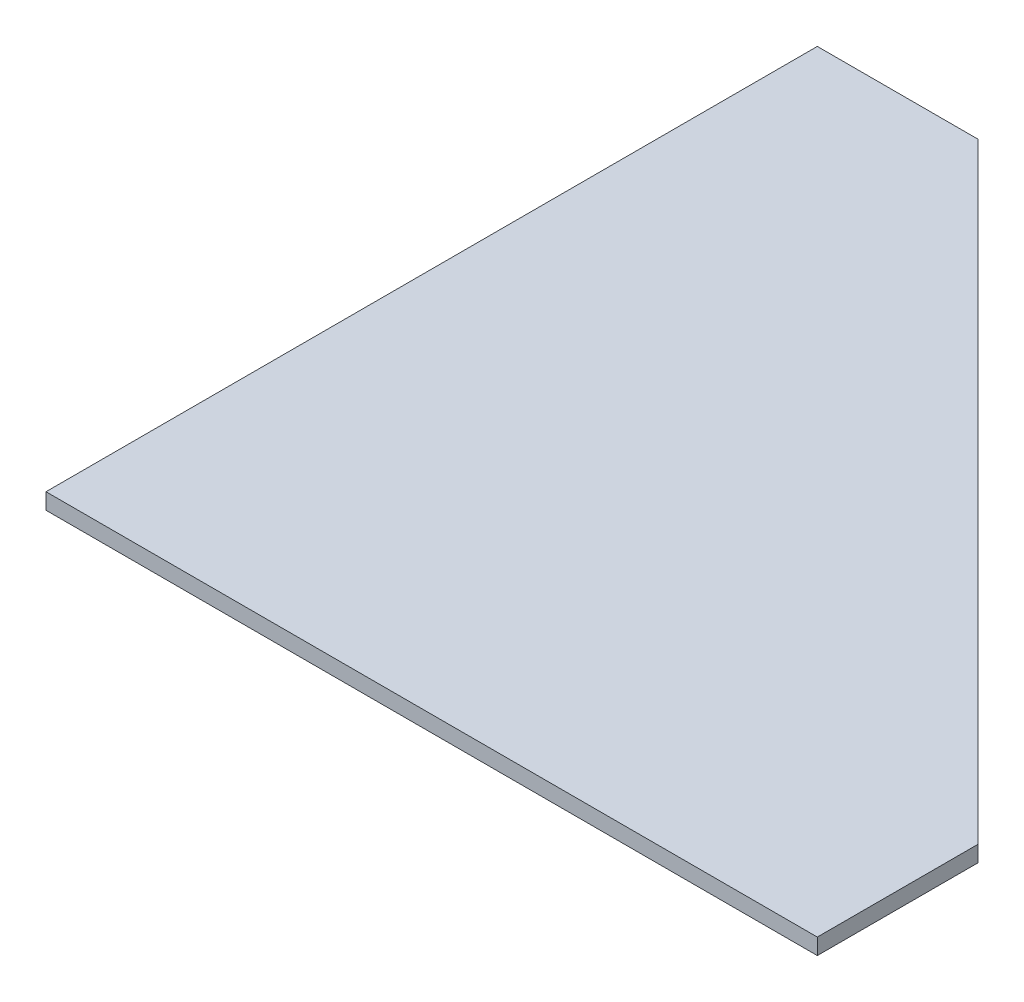
ISO-10303-21;
HEADER;
FILE_DESCRIPTION(('STEP AP214'),'2;1');
FILE_NAME('part.step','',(''),(''),'','','');
FILE_SCHEMA(('AUTOMOTIVE_DESIGN { 1 0 10303 214 1 1 1 1 }'));
ENDSEC;
DATA;
#1=APPLICATION_CONTEXT('core data for automotive mechanical design processes');
#2=APPLICATION_PROTOCOL_DEFINITION('international standard','automotive_design',2000,#1);
#3=PRODUCT_CONTEXT('',#1,'mechanical');
#4=PRODUCT('Part','Part','',(#3));
#5=PRODUCT_RELATED_PRODUCT_CATEGORY('part','',(#4));
#6=PRODUCT_DEFINITION_FORMATION('','',#4);
#7=PRODUCT_DEFINITION_CONTEXT('part definition',#1,'design');
#8=PRODUCT_DEFINITION('design','',#6,#7);
#9=PRODUCT_DEFINITION_SHAPE('','',#8);
#10=(LENGTH_UNIT() NAMED_UNIT(*) SI_UNIT(.MILLI.,.METRE.));
#11=(NAMED_UNIT(*) PLANE_ANGLE_UNIT() SI_UNIT($,.RADIAN.));
#12=(NAMED_UNIT(*) SI_UNIT($,.STERADIAN.) SOLID_ANGLE_UNIT());
#13=UNCERTAINTY_MEASURE_WITH_UNIT(LENGTH_MEASURE(1.E-05),#10,'distance_accuracy_value','');
#14=(GEOMETRIC_REPRESENTATION_CONTEXT(3) GLOBAL_UNCERTAINTY_ASSIGNED_CONTEXT((#13)) GLOBAL_UNIT_ASSIGNED_CONTEXT((#10,
#11,#12)) REPRESENTATION_CONTEXT('',''));
#15=CARTESIAN_POINT('',(0.,0.,0.));
#16=DIRECTION('',(0.,0.,1.));
#17=DIRECTION('',(1.,0.,0.));
#18=AXIS2_PLACEMENT_3D('',#15,#16,#17);
#19=CARTESIAN_POINT('',(0.,12.7,-609.6));
#20=DIRECTION('',(1.,0.,0.));
#21=DIRECTION('',(0.,0.,-1.));
#22=AXIS2_PLACEMENT_3D('',#19,#20,#21);
#23=PLANE('',#22);
#24=DIRECTION('',(0.,0.,1.));
#25=VECTOR('',#24,1.);
#26=CARTESIAN_POINT('',(0.,0.,-609.6));
#27=LINE('',#26,#25);
#28=CARTESIAN_POINT('',(0.,0.,-609.6));
#29=VERTEX_POINT('',#28);
#30=CARTESIAN_POINT('',(0.,0.,0.));
#31=VERTEX_POINT('',#30);
#32=EDGE_CURVE('E118',#29,#31,#27,.T.);
#33=ORIENTED_EDGE('',*,*,#32,.T.);
#34=DIRECTION('',(0.,-1.,0.));
#35=VECTOR('',#34,1.);
#36=CARTESIAN_POINT('',(0.,12.7,0.));
#37=LINE('',#36,#35);
#38=CARTESIAN_POINT('',(0.,12.7,0.));
#39=VERTEX_POINT('',#38);
#40=EDGE_CURVE('E11',#39,#31,#37,.T.);
#41=ORIENTED_EDGE('',*,*,#40,.F.);
#42=DIRECTION('',(0.,0.,1.));
#43=VECTOR('',#42,1.);
#44=CARTESIAN_POINT('',(0.,12.7,-609.6));
#45=LINE('',#44,#43);
#46=CARTESIAN_POINT('',(0.,12.7,-609.6));
#47=VERTEX_POINT('',#46);
#48=EDGE_CURVE('E131',#47,#39,#45,.T.);
#49=ORIENTED_EDGE('',*,*,#48,.F.);
#50=DIRECTION('',(0.,-1.,0.));
#51=VECTOR('',#50,1.);
#52=CARTESIAN_POINT('',(0.,12.7,-609.6));
#53=LINE('',#52,#51);
#54=EDGE_CURVE('E114',#47,#29,#53,.T.);
#55=ORIENTED_EDGE('',*,*,#54,.T.);
#56=EDGE_LOOP('',(#33,#41,#49,#55));
#57=FACE_BOUND('',#56,.T.);
#58=ADVANCED_FACE('F39',(#57),#23,.F.);
#59=CARTESIAN_POINT('',(0.,12.7,0.));
#60=DIRECTION('',(0.,0.,-1.));
#61=DIRECTION('',(-1.,0.,0.));
#62=AXIS2_PLACEMENT_3D('',#59,#60,#61);
#63=PLANE('',#62);
#64=DIRECTION('',(1.,0.,0.));
#65=VECTOR('',#64,1.);
#66=CARTESIAN_POINT('',(0.,0.,0.));
#67=LINE('',#66,#65);
#68=CARTESIAN_POINT('',(609.6,0.,0.));
#69=VERTEX_POINT('',#68);
#70=EDGE_CURVE('E122',#31,#69,#67,.T.);
#71=ORIENTED_EDGE('',*,*,#70,.T.);
#72=DIRECTION('',(0.,-1.,0.));
#73=VECTOR('',#72,1.);
#74=CARTESIAN_POINT('',(609.6,12.7,0.));
#75=LINE('',#74,#73);
#76=CARTESIAN_POINT('',(609.6,12.7,0.));
#77=VERTEX_POINT('',#76);
#78=EDGE_CURVE('E48',#77,#69,#75,.T.);
#79=ORIENTED_EDGE('',*,*,#78,.F.);
#80=DIRECTION('',(1.,0.,0.));
#81=VECTOR('',#80,1.);
#82=CARTESIAN_POINT('',(0.,12.7,0.));
#83=LINE('',#82,#81);
#84=EDGE_CURVE('E90',#39,#77,#83,.T.);
#85=ORIENTED_EDGE('',*,*,#84,.F.);
#86=ORIENTED_EDGE('',*,*,#40,.T.);
#87=EDGE_LOOP('',(#71,#79,#85,#86));
#88=FACE_BOUND('',#87,.T.);
#89=ADVANCED_FACE('F153',(#88),#63,.F.);
#90=CARTESIAN_POINT('',(609.6,12.7,0.));
#91=DIRECTION('',(-1.,0.,0.));
#92=DIRECTION('',(0.,0.,1.));
#93=AXIS2_PLACEMENT_3D('',#90,#91,#92);
#94=PLANE('',#93);
#95=DIRECTION('',(0.,0.,-1.));
#96=VECTOR('',#95,1.);
#97=CARTESIAN_POINT('',(609.6,0.,0.));
#98=LINE('',#97,#96);
#99=CARTESIAN_POINT('',(609.6,0.,-127.));
#100=VERTEX_POINT('',#99);
#101=EDGE_CURVE('E106',#69,#100,#98,.T.);
#102=ORIENTED_EDGE('',*,*,#101,.T.);
#103=DIRECTION('',(0.,-1.,0.));
#104=VECTOR('',#103,1.);
#105=CARTESIAN_POINT('',(609.6,12.7,-127.));
#106=LINE('',#105,#104);
#107=CARTESIAN_POINT('',(609.6,12.7,-127.));
#108=VERTEX_POINT('',#107);
#109=EDGE_CURVE('E103',#108,#100,#106,.T.);
#110=ORIENTED_EDGE('',*,*,#109,.F.);
#111=DIRECTION('',(0.,0.,-1.));
#112=VECTOR('',#111,1.);
#113=CARTESIAN_POINT('',(609.6,12.7,0.));
#114=LINE('',#113,#112);
#115=EDGE_CURVE('E94',#77,#108,#114,.T.);
#116=ORIENTED_EDGE('',*,*,#115,.F.);
#117=ORIENTED_EDGE('',*,*,#78,.T.);
#118=EDGE_LOOP('',(#102,#110,#116,#117));
#119=FACE_BOUND('',#118,.T.);
#120=ADVANCED_FACE('F104',(#119),#94,.F.);
#121=CARTESIAN_POINT('',(609.6,12.7,-127.));
#122=DIRECTION('',(-0.707106781186546,0.,0.707106781186549));
#123=DIRECTION('',(0.707106781186549,0.,0.707106781186546));
#124=AXIS2_PLACEMENT_3D('',#121,#122,#123);
#125=PLANE('',#124);
#126=DIRECTION('',(-0.707106781186549,0.,-0.707106781186546));
#127=VECTOR('',#126,1.);
#128=CARTESIAN_POINT('',(609.6,0.,-127.));
#129=LINE('',#128,#127);
#130=CARTESIAN_POINT('',(126.999999999998,0.,-609.6));
#131=VERTEX_POINT('',#130);
#132=EDGE_CURVE('E76',#100,#131,#129,.T.);
#133=ORIENTED_EDGE('',*,*,#132,.T.);
#134=DIRECTION('',(0.,-1.,0.));
#135=VECTOR('',#134,1.);
#136=CARTESIAN_POINT('',(126.999999999998,12.7,-609.6));
#137=LINE('',#136,#135);
#138=CARTESIAN_POINT('',(126.999999999998,12.7,-609.6));
#139=VERTEX_POINT('',#138);
#140=EDGE_CURVE('E108',#139,#131,#137,.T.);
#141=ORIENTED_EDGE('',*,*,#140,.F.);
#142=DIRECTION('',(-0.707106781186549,0.,-0.707106781186546));
#143=VECTOR('',#142,1.);
#144=CARTESIAN_POINT('',(609.6,12.7,-127.));
#145=LINE('',#144,#143);
#146=EDGE_CURVE('E98',#108,#139,#145,.T.);
#147=ORIENTED_EDGE('',*,*,#146,.F.);
#148=ORIENTED_EDGE('',*,*,#109,.T.);
#149=EDGE_LOOP('',(#133,#141,#147,#148));
#150=FACE_BOUND('',#149,.T.);
#151=ADVANCED_FACE('F110',(#150),#125,.F.);
#152=CARTESIAN_POINT('',(126.999999999998,12.7,-609.6));
#153=DIRECTION('',(0.,0.,1.));
#154=DIRECTION('',(1.,0.,0.));
#155=AXIS2_PLACEMENT_3D('',#152,#153,#154);
#156=PLANE('',#155);
#157=DIRECTION('',(-1.,0.,0.));
#158=VECTOR('',#157,1.);
#159=CARTESIAN_POINT('',(126.999999999998,0.,-609.6));
#160=LINE('',#159,#158);
#161=EDGE_CURVE('E82',#131,#29,#160,.T.);
#162=ORIENTED_EDGE('',*,*,#161,.T.);
#163=ORIENTED_EDGE('',*,*,#54,.F.);
#164=DIRECTION('',(-1.,0.,0.));
#165=VECTOR('',#164,1.);
#166=CARTESIAN_POINT('',(126.999999999998,12.7,-609.6));
#167=LINE('',#166,#165);
#168=EDGE_CURVE('E56',#139,#47,#167,.T.);
#169=ORIENTED_EDGE('',*,*,#168,.F.);
#170=ORIENTED_EDGE('',*,*,#140,.T.);
#171=EDGE_LOOP('',(#162,#163,#169,#170));
#172=FACE_BOUND('',#171,.T.);
#173=ADVANCED_FACE('F142',(#172),#156,.F.);
#174=CARTESIAN_POINT('',(0.,12.7,0.));
#175=DIRECTION('',(0.,1.,0.));
#176=DIRECTION('',(0.,0.,1.));
#177=AXIS2_PLACEMENT_3D('',#174,#175,#176);
#178=PLANE('',#177);
#179=ORIENTED_EDGE('',*,*,#48,.T.);
#180=ORIENTED_EDGE('',*,*,#84,.T.);
#181=ORIENTED_EDGE('',*,*,#115,.T.);
#182=ORIENTED_EDGE('',*,*,#146,.T.);
#183=ORIENTED_EDGE('',*,*,#168,.T.);
#184=EDGE_LOOP('',(#179,#180,#181,#182,#183));
#185=FACE_BOUND('',#184,.T.);
#186=ADVANCED_FACE('F96',(#185),#178,.T.);
#187=CARTESIAN_POINT('',(0.,0.,0.));
#188=DIRECTION('',(0.,1.,0.));
#189=DIRECTION('',(0.,0.,1.));
#190=AXIS2_PLACEMENT_3D('',#187,#188,#189);
#191=PLANE('',#190);
#192=ORIENTED_EDGE('',*,*,#32,.F.);
#193=ORIENTED_EDGE('',*,*,#161,.F.);
#194=ORIENTED_EDGE('',*,*,#132,.F.);
#195=ORIENTED_EDGE('',*,*,#101,.F.);
#196=ORIENTED_EDGE('',*,*,#70,.F.);
#197=EDGE_LOOP('',(#192,#193,#194,#195,#196));
#198=FACE_BOUND('',#197,.T.);
#199=ADVANCED_FACE('F138',(#198),#191,.F.);
#200=CLOSED_SHELL('',(#58,#89,#120,#151,#173,#186,#199));
#201=MANIFOLD_SOLID_BREP('B2',#200);
#202=ADVANCED_BREP_SHAPE_REPRESENTATION('',(#18,#201),#14);
#203=SHAPE_DEFINITION_REPRESENTATION(#9,#202);
ENDSEC;
END-ISO-10303-21;
